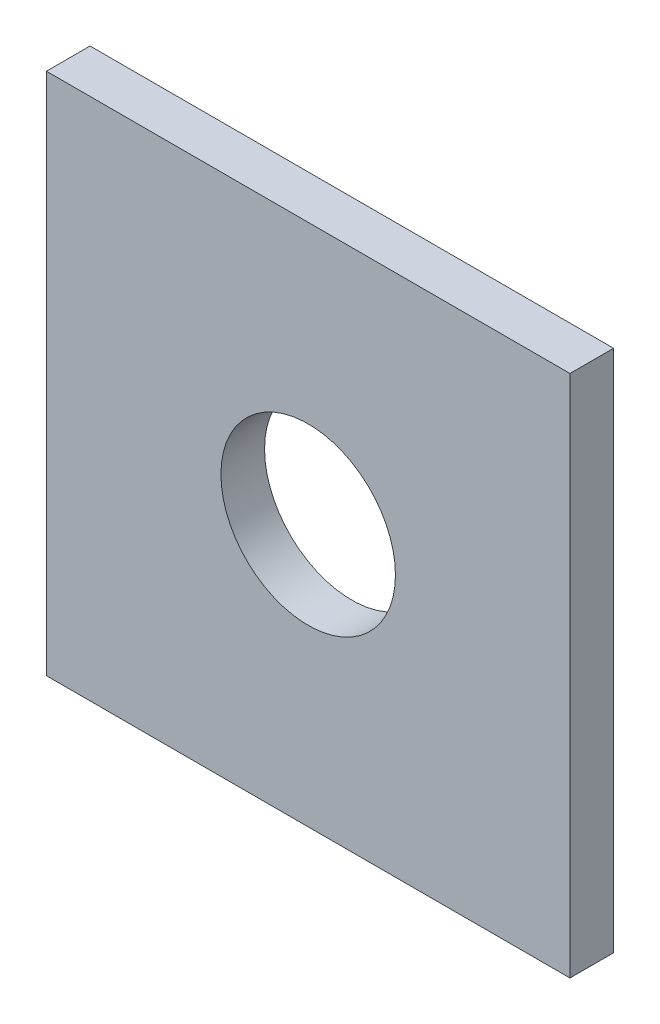
ISO-10303-21;
HEADER;
FILE_DESCRIPTION(('STEP AP214'),'2;1');
FILE_NAME('part.step','',(''),(''),'','','');
FILE_SCHEMA(('AUTOMOTIVE_DESIGN { 1 0 10303 214 1 1 1 1 }'));
ENDSEC;
DATA;
#1=APPLICATION_CONTEXT('core data for automotive mechanical design processes');
#2=APPLICATION_PROTOCOL_DEFINITION('international standard','automotive_design',2000,#1);
#3=PRODUCT_CONTEXT('',#1,'mechanical');
#4=PRODUCT('Part','Part','',(#3));
#5=PRODUCT_RELATED_PRODUCT_CATEGORY('part','',(#4));
#6=PRODUCT_DEFINITION_FORMATION('','',#4);
#7=PRODUCT_DEFINITION_CONTEXT('part definition',#1,'design');
#8=PRODUCT_DEFINITION('design','',#6,#7);
#9=PRODUCT_DEFINITION_SHAPE('','',#8);
#10=(LENGTH_UNIT() NAMED_UNIT(*) SI_UNIT(.MILLI.,.METRE.));
#11=(NAMED_UNIT(*) PLANE_ANGLE_UNIT() SI_UNIT($,.RADIAN.));
#12=(NAMED_UNIT(*) SI_UNIT($,.STERADIAN.) SOLID_ANGLE_UNIT());
#13=UNCERTAINTY_MEASURE_WITH_UNIT(LENGTH_MEASURE(1.E-05),#10,'distance_accuracy_value','');
#14=(GEOMETRIC_REPRESENTATION_CONTEXT(3) GLOBAL_UNCERTAINTY_ASSIGNED_CONTEXT((#13)) GLOBAL_UNIT_ASSIGNED_CONTEXT((#10,
#11,#12)) REPRESENTATION_CONTEXT('',''));
#15=CARTESIAN_POINT('',(0.,0.,0.));
#16=DIRECTION('',(0.,0.,1.));
#17=DIRECTION('',(1.,0.,0.));
#18=AXIS2_PLACEMENT_3D('',#15,#16,#17);
#19=CARTESIAN_POINT('',(0.,0.,6.35));
#20=DIRECTION('',(0.,0.,-1.));
#21=DIRECTION('',(-1.,0.,0.));
#22=AXIS2_PLACEMENT_3D('',#19,#20,#21);
#23=PLANE('',#22);
#24=DIRECTION('',(0.,-1.,0.));
#25=VECTOR('',#24,1.);
#26=CARTESIAN_POINT('',(0.,0.,6.35));
#27=LINE('',#26,#25);
#28=CARTESIAN_POINT('',(0.,76.2,6.35));
#29=VERTEX_POINT('',#28);
#30=CARTESIAN_POINT('',(0.,0.,6.35));
#31=VERTEX_POINT('',#30);
#32=EDGE_CURVE('E97',#29,#31,#27,.T.);
#33=ORIENTED_EDGE('',*,*,#32,.T.);
#34=DIRECTION('',(1.,0.,0.));
#35=VECTOR('',#34,1.);
#36=CARTESIAN_POINT('',(0.,0.,6.35));
#37=LINE('',#36,#35);
#38=CARTESIAN_POINT('',(76.2,0.,6.35));
#39=VERTEX_POINT('',#38);
#40=EDGE_CURVE('E92',#31,#39,#37,.T.);
#41=ORIENTED_EDGE('',*,*,#40,.T.);
#42=DIRECTION('',(0.,1.,0.));
#43=VECTOR('',#42,1.);
#44=CARTESIAN_POINT('',(76.2,0.,6.35));
#45=LINE('',#44,#43);
#46=CARTESIAN_POINT('',(76.2,76.2,6.35));
#47=VERTEX_POINT('',#46);
#48=EDGE_CURVE('E95',#39,#47,#45,.T.);
#49=ORIENTED_EDGE('',*,*,#48,.T.);
#50=DIRECTION('',(-1.,0.,0.));
#51=VECTOR('',#50,1.);
#52=CARTESIAN_POINT('',(0.,76.2,6.35));
#53=LINE('',#52,#51);
#54=EDGE_CURVE('E62',#47,#29,#53,.T.);
#55=ORIENTED_EDGE('',*,*,#54,.T.);
#56=EDGE_LOOP('',(#33,#41,#49,#55));
#57=FACE_BOUND('',#56,.T.);
#58=CARTESIAN_POINT('',(38.1,38.1,6.35));
#59=DIRECTION('',(0.,0.,1.));
#60=DIRECTION('',(1.,0.,0.));
#61=AXIS2_PLACEMENT_3D('',#58,#59,#60);
#62=CIRCLE('',#61,12.7);
#63=CARTESIAN_POINT('',(50.8,38.1,6.35));
#64=VERTEX_POINT('',#63);
#65=EDGE_CURVE('E117',#64,#64,#62,.T.);
#66=ORIENTED_EDGE('',*,*,#65,.F.);
#67=EDGE_LOOP('',(#66));
#68=FACE_BOUND('',#67,.T.);
#69=ADVANCED_FACE('F44',(#57,#68),#23,.F.);
#70=CARTESIAN_POINT('',(0.,0.,0.));
#71=DIRECTION('',(0.,0.,-1.));
#72=DIRECTION('',(-1.,0.,0.));
#73=AXIS2_PLACEMENT_3D('',#70,#71,#72);
#74=PLANE('',#73);
#75=DIRECTION('',(0.,-1.,0.));
#76=VECTOR('',#75,1.);
#77=CARTESIAN_POINT('',(0.,0.,0.));
#78=LINE('',#77,#76);
#79=CARTESIAN_POINT('',(0.,76.2,0.));
#80=VERTEX_POINT('',#79);
#81=CARTESIAN_POINT('',(0.,0.,0.));
#82=VERTEX_POINT('',#81);
#83=EDGE_CURVE('E113',#80,#82,#78,.T.);
#84=ORIENTED_EDGE('',*,*,#83,.F.);
#85=DIRECTION('',(-1.,0.,0.));
#86=VECTOR('',#85,1.);
#87=CARTESIAN_POINT('',(0.,76.2,0.));
#88=LINE('',#87,#86);
#89=CARTESIAN_POINT('',(76.2,76.2,0.));
#90=VERTEX_POINT('',#89);
#91=EDGE_CURVE('E85',#90,#80,#88,.T.);
#92=ORIENTED_EDGE('',*,*,#91,.F.);
#93=DIRECTION('',(0.,1.,0.));
#94=VECTOR('',#93,1.);
#95=CARTESIAN_POINT('',(76.2,0.,0.));
#96=LINE('',#95,#94);
#97=CARTESIAN_POINT('',(76.2,0.,0.));
#98=VERTEX_POINT('',#97);
#99=EDGE_CURVE('E79',#98,#90,#96,.T.);
#100=ORIENTED_EDGE('',*,*,#99,.F.);
#101=DIRECTION('',(1.,0.,0.));
#102=VECTOR('',#101,1.);
#103=CARTESIAN_POINT('',(0.,0.,0.));
#104=LINE('',#103,#102);
#105=EDGE_CURVE('E102',#82,#98,#104,.T.);
#106=ORIENTED_EDGE('',*,*,#105,.F.);
#107=EDGE_LOOP('',(#84,#92,#100,#106));
#108=FACE_BOUND('',#107,.T.);
#109=CARTESIAN_POINT('',(38.1,38.1,0.));
#110=DIRECTION('',(0.,0.,1.));
#111=DIRECTION('',(1.,0.,0.));
#112=AXIS2_PLACEMENT_3D('',#109,#110,#111);
#113=CIRCLE('',#112,12.7);
#114=CARTESIAN_POINT('',(50.8,38.1,0.));
#115=VERTEX_POINT('',#114);
#116=EDGE_CURVE('E135',#115,#115,#113,.T.);
#117=ORIENTED_EDGE('',*,*,#116,.T.);
#118=EDGE_LOOP('',(#117));
#119=FACE_BOUND('',#118,.T.);
#120=ADVANCED_FACE('F130',(#108,#119),#74,.T.);
#121=CARTESIAN_POINT('',(0.,0.,6.35));
#122=DIRECTION('',(1.,0.,0.));
#123=DIRECTION('',(0.,0.,-1.));
#124=AXIS2_PLACEMENT_3D('',#121,#122,#123);
#125=PLANE('',#124);
#126=ORIENTED_EDGE('',*,*,#83,.T.);
#127=DIRECTION('',(0.,0.,-1.));
#128=VECTOR('',#127,1.);
#129=CARTESIAN_POINT('',(0.,0.,6.35));
#130=LINE('',#129,#128);
#131=EDGE_CURVE('E11',#31,#82,#130,.T.);
#132=ORIENTED_EDGE('',*,*,#131,.F.);
#133=ORIENTED_EDGE('',*,*,#32,.F.);
#134=DIRECTION('',(0.,0.,-1.));
#135=VECTOR('',#134,1.);
#136=CARTESIAN_POINT('',(0.,76.2,6.35));
#137=LINE('',#136,#135);
#138=EDGE_CURVE('E109',#29,#80,#137,.T.);
#139=ORIENTED_EDGE('',*,*,#138,.T.);
#140=EDGE_LOOP('',(#126,#132,#133,#139));
#141=FACE_BOUND('',#140,.T.);
#142=ADVANCED_FACE('F46',(#141),#125,.F.);
#143=CARTESIAN_POINT('',(0.,0.,6.35));
#144=DIRECTION('',(0.,1.,0.));
#145=DIRECTION('',(0.,0.,1.));
#146=AXIS2_PLACEMENT_3D('',#143,#144,#145);
#147=PLANE('',#146);
#148=ORIENTED_EDGE('',*,*,#105,.T.);
#149=DIRECTION('',(0.,0.,-1.));
#150=VECTOR('',#149,1.);
#151=CARTESIAN_POINT('',(76.2,0.,6.35));
#152=LINE('',#151,#150);
#153=EDGE_CURVE('E54',#39,#98,#152,.T.);
#154=ORIENTED_EDGE('',*,*,#153,.F.);
#155=ORIENTED_EDGE('',*,*,#40,.F.);
#156=ORIENTED_EDGE('',*,*,#131,.T.);
#157=EDGE_LOOP('',(#148,#154,#155,#156));
#158=FACE_BOUND('',#157,.T.);
#159=ADVANCED_FACE('F101',(#158),#147,.F.);
#160=CARTESIAN_POINT('',(76.2,0.,6.35));
#161=DIRECTION('',(-1.,0.,0.));
#162=DIRECTION('',(0.,0.,1.));
#163=AXIS2_PLACEMENT_3D('',#160,#161,#162);
#164=PLANE('',#163);
#165=ORIENTED_EDGE('',*,*,#99,.T.);
#166=DIRECTION('',(0.,0.,-1.));
#167=VECTOR('',#166,1.);
#168=CARTESIAN_POINT('',(76.2,76.2,6.35));
#169=LINE('',#168,#167);
#170=EDGE_CURVE('E104',#47,#90,#169,.T.);
#171=ORIENTED_EDGE('',*,*,#170,.F.);
#172=ORIENTED_EDGE('',*,*,#48,.F.);
#173=ORIENTED_EDGE('',*,*,#153,.T.);
#174=EDGE_LOOP('',(#165,#171,#172,#173));
#175=FACE_BOUND('',#174,.T.);
#176=ADVANCED_FACE('F105',(#175),#164,.F.);
#177=CARTESIAN_POINT('',(0.,76.2,6.35));
#178=DIRECTION('',(0.,-1.,0.));
#179=DIRECTION('',(0.,0.,-1.));
#180=AXIS2_PLACEMENT_3D('',#177,#178,#179);
#181=PLANE('',#180);
#182=ORIENTED_EDGE('',*,*,#91,.T.);
#183=ORIENTED_EDGE('',*,*,#138,.F.);
#184=ORIENTED_EDGE('',*,*,#54,.F.);
#185=ORIENTED_EDGE('',*,*,#170,.T.);
#186=EDGE_LOOP('',(#182,#183,#184,#185));
#187=FACE_BOUND('',#186,.T.);
#188=ADVANCED_FACE('F127',(#187),#181,.F.);
#189=CARTESIAN_POINT('',(38.1,38.1,6.35));
#190=DIRECTION('',(0.,0.,-1.));
#191=DIRECTION('',(-1.,0.,0.));
#192=AXIS2_PLACEMENT_3D('',#189,#190,#191);
#193=CYLINDRICAL_SURFACE('',#192,12.7);
#194=ORIENTED_EDGE('',*,*,#65,.T.);
#195=EDGE_LOOP('',(#194));
#196=FACE_BOUND('',#195,.T.);
#197=ORIENTED_EDGE('',*,*,#116,.F.);
#198=EDGE_LOOP('',(#197));
#199=FACE_BOUND('',#198,.T.);
#200=ADVANCED_FACE('F143',(#196,#199),#193,.F.);
#201=CLOSED_SHELL('',(#69,#120,#142,#159,#176,#188,#200));
#202=MANIFOLD_SOLID_BREP('B2',#201);
#203=ADVANCED_BREP_SHAPE_REPRESENTATION('',(#18,#202),#14);
#204=SHAPE_DEFINITION_REPRESENTATION(#9,#203);
ENDSEC;
END-ISO-10303-21;
